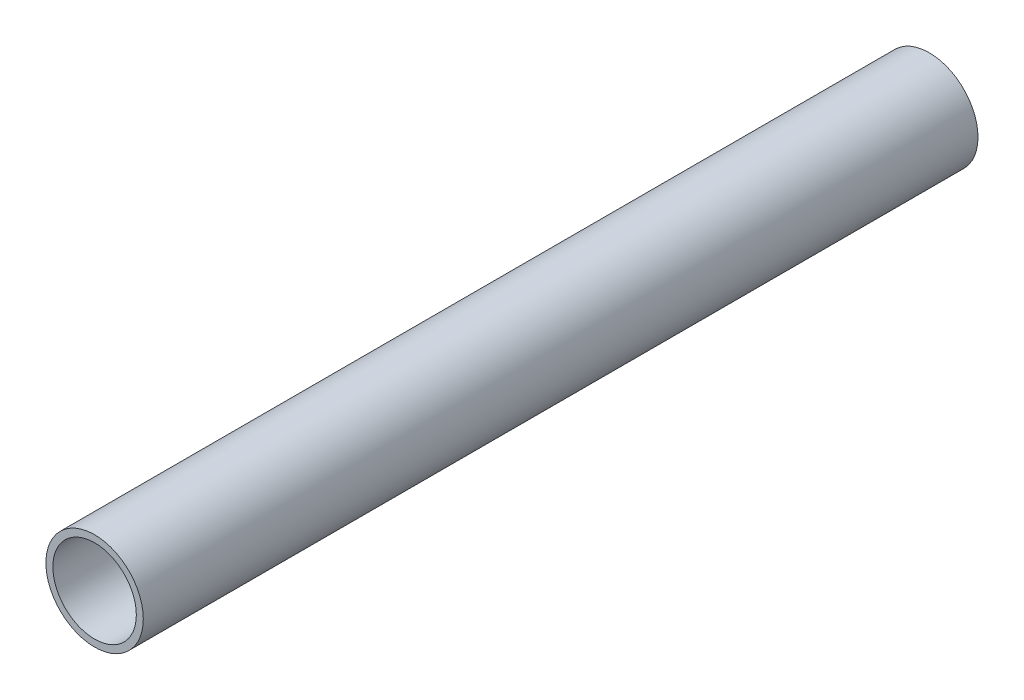
ISO-10303-21;
HEADER;
FILE_DESCRIPTION(('STEP AP214'),'2;1');
FILE_NAME('part.step','',(''),(''),'','','');
FILE_SCHEMA(('AUTOMOTIVE_DESIGN { 1 0 10303 214 1 1 1 1 }'));
ENDSEC;
DATA;
#1=APPLICATION_CONTEXT('core data for automotive mechanical design processes');
#2=APPLICATION_PROTOCOL_DEFINITION('international standard','automotive_design',2000,#1);
#3=PRODUCT_CONTEXT('',#1,'mechanical');
#4=PRODUCT('Part','Part','',(#3));
#5=PRODUCT_RELATED_PRODUCT_CATEGORY('part','',(#4));
#6=PRODUCT_DEFINITION_FORMATION('','',#4);
#7=PRODUCT_DEFINITION_CONTEXT('part definition',#1,'design');
#8=PRODUCT_DEFINITION('design','',#6,#7);
#9=PRODUCT_DEFINITION_SHAPE('','',#8);
#10=(LENGTH_UNIT() NAMED_UNIT(*) SI_UNIT(.MILLI.,.METRE.));
#11=(NAMED_UNIT(*) PLANE_ANGLE_UNIT() SI_UNIT($,.RADIAN.));
#12=(NAMED_UNIT(*) SI_UNIT($,.STERADIAN.) SOLID_ANGLE_UNIT());
#13=UNCERTAINTY_MEASURE_WITH_UNIT(LENGTH_MEASURE(1.E-05),#10,'distance_accuracy_value','');
#14=(GEOMETRIC_REPRESENTATION_CONTEXT(3) GLOBAL_UNCERTAINTY_ASSIGNED_CONTEXT((#13)) GLOBAL_UNIT_ASSIGNED_CONTEXT((#10,
#11,#12)) REPRESENTATION_CONTEXT('',''));
#15=CARTESIAN_POINT('',(0.,0.,0.));
#16=DIRECTION('',(0.,0.,1.));
#17=DIRECTION('',(1.,0.,0.));
#18=AXIS2_PLACEMENT_3D('',#15,#16,#17);
#19=CARTESIAN_POINT('',(0.,0.,95.25));
#20=DIRECTION('',(0.,0.,1.));
#21=DIRECTION('',(1.,0.,0.));
#22=AXIS2_PLACEMENT_3D('',#19,#20,#21);
#23=PLANE('',#22);
#24=CARTESIAN_POINT('',(0.,0.,95.25));
#25=DIRECTION('',(0.,0.,1.));
#26=DIRECTION('',(1.,0.,0.));
#27=AXIS2_PLACEMENT_3D('',#24,#25,#26);
#28=CIRCLE('',#27,11.1125);
#29=CARTESIAN_POINT('',(11.1125,0.,95.25));
#30=VERTEX_POINT('',#29);
#31=EDGE_CURVE('E10',#30,#30,#28,.T.);
#32=ORIENTED_EDGE('',*,*,#31,.T.);
#33=EDGE_LOOP('',(#32));
#34=FACE_BOUND('',#33,.T.);
#35=CARTESIAN_POINT('',(0.,0.,95.25));
#36=DIRECTION('',(0.,0.,1.));
#37=DIRECTION('',(1.,0.,0.));
#38=AXIS2_PLACEMENT_3D('',#35,#36,#37);
#39=CIRCLE('',#38,9.525);
#40=CARTESIAN_POINT('',(9.525,0.,95.25));
#41=VERTEX_POINT('',#40);
#42=EDGE_CURVE('E50',#41,#41,#39,.T.);
#43=ORIENTED_EDGE('',*,*,#42,.F.);
#44=EDGE_LOOP('',(#43));
#45=FACE_BOUND('',#44,.T.);
#46=ADVANCED_FACE('F39',(#34,#45),#23,.T.);
#47=CARTESIAN_POINT('',(0.,0.,-95.25));
#48=DIRECTION('',(0.,0.,1.));
#49=DIRECTION('',(1.,0.,0.));
#50=AXIS2_PLACEMENT_3D('',#47,#48,#49);
#51=PLANE('',#50);
#52=CARTESIAN_POINT('',(0.,0.,-95.25));
#53=DIRECTION('',(0.,0.,1.));
#54=DIRECTION('',(1.,0.,0.));
#55=AXIS2_PLACEMENT_3D('',#52,#53,#54);
#56=CIRCLE('',#55,11.1125);
#57=CARTESIAN_POINT('',(11.1125,0.,-95.25));
#58=VERTEX_POINT('',#57);
#59=EDGE_CURVE('E43',#58,#58,#56,.T.);
#60=ORIENTED_EDGE('',*,*,#59,.F.);
#61=EDGE_LOOP('',(#60));
#62=FACE_BOUND('',#61,.T.);
#63=CARTESIAN_POINT('',(0.,0.,-95.25));
#64=DIRECTION('',(0.,0.,1.));
#65=DIRECTION('',(1.,0.,0.));
#66=AXIS2_PLACEMENT_3D('',#63,#64,#65);
#67=CIRCLE('',#66,9.525);
#68=CARTESIAN_POINT('',(9.525,0.,-95.25));
#69=VERTEX_POINT('',#68);
#70=EDGE_CURVE('E52',#69,#69,#67,.T.);
#71=ORIENTED_EDGE('',*,*,#70,.T.);
#72=EDGE_LOOP('',(#71));
#73=FACE_BOUND('',#72,.T.);
#74=ADVANCED_FACE('F62',(#62,#73),#51,.F.);
#75=CARTESIAN_POINT('',(0.,0.,95.25));
#76=DIRECTION('',(0.,0.,-1.));
#77=DIRECTION('',(-1.,0.,0.));
#78=AXIS2_PLACEMENT_3D('',#75,#76,#77);
#79=CYLINDRICAL_SURFACE('',#78,11.1125);
#80=ORIENTED_EDGE('',*,*,#31,.F.);
#81=EDGE_LOOP('',(#80));
#82=FACE_BOUND('',#81,.T.);
#83=ORIENTED_EDGE('',*,*,#59,.T.);
#84=EDGE_LOOP('',(#83));
#85=FACE_BOUND('',#84,.T.);
#86=ADVANCED_FACE('F41',(#82,#85),#79,.T.);
#87=CARTESIAN_POINT('',(0.,0.,95.25));
#88=DIRECTION('',(0.,0.,-1.));
#89=DIRECTION('',(-1.,0.,0.));
#90=AXIS2_PLACEMENT_3D('',#87,#88,#89);
#91=CYLINDRICAL_SURFACE('',#90,9.525);
#92=ORIENTED_EDGE('',*,*,#42,.T.);
#93=EDGE_LOOP('',(#92));
#94=FACE_BOUND('',#93,.T.);
#95=ORIENTED_EDGE('',*,*,#70,.F.);
#96=EDGE_LOOP('',(#95));
#97=FACE_BOUND('',#96,.T.);
#98=ADVANCED_FACE('F58',(#94,#97),#91,.F.);
#99=CLOSED_SHELL('',(#46,#74,#86,#98));
#100=MANIFOLD_SOLID_BREP('B2',#99);
#101=ADVANCED_BREP_SHAPE_REPRESENTATION('',(#18,#100),#14);
#102=SHAPE_DEFINITION_REPRESENTATION(#9,#101);
ENDSEC;
END-ISO-10303-21;
